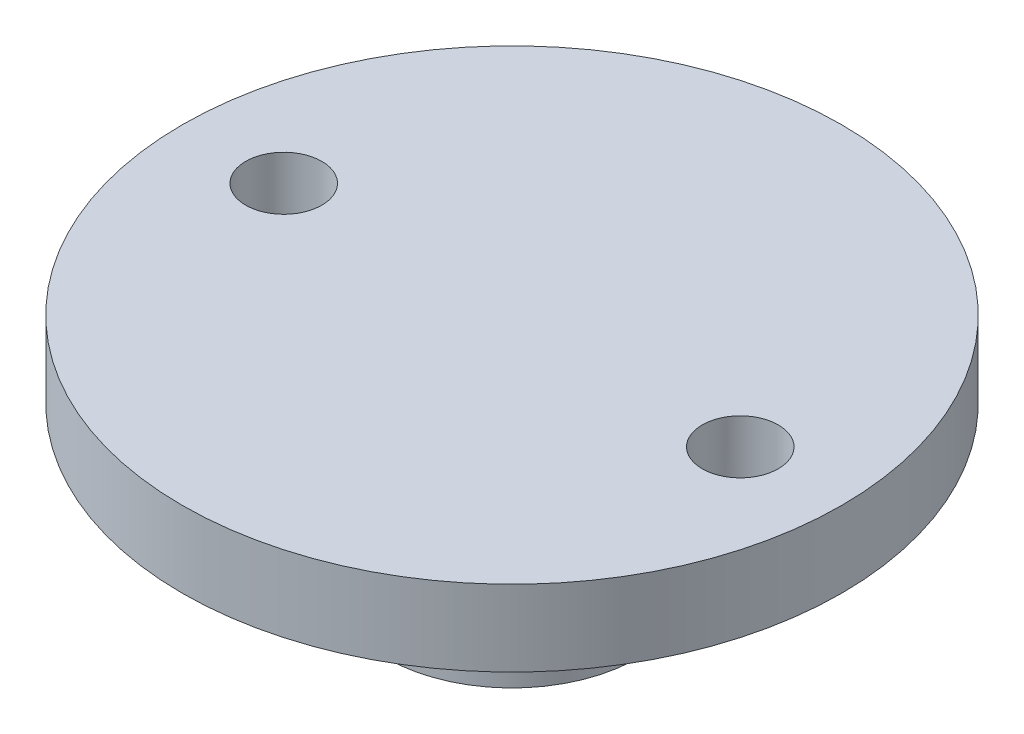
ISO-10303-21;
HEADER;
FILE_DESCRIPTION(('STEP AP214'),'2;1');
FILE_NAME('part.step','',(''),(''),'','','');
FILE_SCHEMA(('AUTOMOTIVE_DESIGN { 1 0 10303 214 1 1 1 1 }'));
ENDSEC;
DATA;
#1=APPLICATION_CONTEXT('core data for automotive mechanical design processes');
#2=APPLICATION_PROTOCOL_DEFINITION('international standard','automotive_design',2000,#1);
#3=PRODUCT_CONTEXT('',#1,'mechanical');
#4=PRODUCT('Part','Part','',(#3));
#5=PRODUCT_RELATED_PRODUCT_CATEGORY('part','',(#4));
#6=PRODUCT_DEFINITION_FORMATION('','',#4);
#7=PRODUCT_DEFINITION_CONTEXT('part definition',#1,'design');
#8=PRODUCT_DEFINITION('design','',#6,#7);
#9=PRODUCT_DEFINITION_SHAPE('','',#8);
#10=(LENGTH_UNIT() NAMED_UNIT(*) SI_UNIT(.MILLI.,.METRE.));
#11=(NAMED_UNIT(*) PLANE_ANGLE_UNIT() SI_UNIT($,.RADIAN.));
#12=(NAMED_UNIT(*) SI_UNIT($,.STERADIAN.) SOLID_ANGLE_UNIT());
#13=UNCERTAINTY_MEASURE_WITH_UNIT(LENGTH_MEASURE(1.E-05),#10,'distance_accuracy_value','');
#14=(GEOMETRIC_REPRESENTATION_CONTEXT(3) GLOBAL_UNCERTAINTY_ASSIGNED_CONTEXT((#13)) GLOBAL_UNIT_ASSIGNED_CONTEXT((#10,
#11,#12)) REPRESENTATION_CONTEXT('',''));
#15=CARTESIAN_POINT('',(0.,0.,0.));
#16=DIRECTION('',(0.,0.,1.));
#17=DIRECTION('',(1.,0.,0.));
#18=AXIS2_PLACEMENT_3D('',#15,#16,#17);
#19=CARTESIAN_POINT('',(0.,0.,0.));
#20=DIRECTION('',(0.,1.,0.));
#21=DIRECTION('',(0.,0.,1.));
#22=AXIS2_PLACEMENT_3D('',#19,#20,#21);
#23=PLANE('',#22);
#24=CARTESIAN_POINT('',(-9.,0.,0.));
#25=DIRECTION('',(0.,1.,0.));
#26=DIRECTION('',(0.,0.,-1.));
#27=AXIS2_PLACEMENT_3D('',#24,#25,#26);
#28=CIRCLE('',#27,1.5);
#29=CARTESIAN_POINT('',(-9.,0.,-1.5));
#30=VERTEX_POINT('',#29);
#31=EDGE_CURVE('E59',#30,#30,#28,.T.);
#32=ORIENTED_EDGE('',*,*,#31,.F.);
#33=EDGE_LOOP('',(#32));
#34=FACE_BOUND('',#33,.T.);
#35=CARTESIAN_POINT('',(9.,0.,0.));
#36=DIRECTION('',(0.,1.,0.));
#37=DIRECTION('',(0.,0.,1.));
#38=AXIS2_PLACEMENT_3D('',#35,#36,#37);
#39=CIRCLE('',#38,1.5);
#40=CARTESIAN_POINT('',(9.,0.,1.5));
#41=VERTEX_POINT('',#40);
#42=EDGE_CURVE('E48',#41,#41,#39,.T.);
#43=ORIENTED_EDGE('',*,*,#42,.F.);
#44=EDGE_LOOP('',(#43));
#45=FACE_BOUND('',#44,.T.);
#46=CARTESIAN_POINT('',(0.,0.,0.));
#47=DIRECTION('',(0.,-1.,0.));
#48=DIRECTION('',(0.,0.,-1.));
#49=AXIS2_PLACEMENT_3D('',#46,#47,#48);
#50=CIRCLE('',#49,13.);
#51=CARTESIAN_POINT('',(0.,0.,-13.));
#52=VERTEX_POINT('',#51);
#53=EDGE_CURVE('E10',#52,#52,#50,.T.);
#54=ORIENTED_EDGE('',*,*,#53,.F.);
#55=EDGE_LOOP('',(#54));
#56=FACE_BOUND('',#55,.T.);
#57=ADVANCED_FACE('F30',(#34,#45,#56),#23,.T.);
#58=CARTESIAN_POINT('',(0.,0.,0.));
#59=DIRECTION('',(0.,-1.,0.));
#60=DIRECTION('',(0.,0.,-1.));
#61=AXIS2_PLACEMENT_3D('',#58,#59,#60);
#62=CYLINDRICAL_SURFACE('',#61,13.);
#63=ORIENTED_EDGE('',*,*,#53,.T.);
#64=EDGE_LOOP('',(#63));
#65=FACE_BOUND('',#64,.T.);
#66=CARTESIAN_POINT('',(0.,-3.,0.));
#67=DIRECTION('',(0.,-1.,0.));
#68=DIRECTION('',(0.,0.,-1.));
#69=AXIS2_PLACEMENT_3D('',#66,#67,#68);
#70=CIRCLE('',#69,13.);
#71=CARTESIAN_POINT('',(0.,-3.,-13.));
#72=VERTEX_POINT('',#71);
#73=EDGE_CURVE('E37',#72,#72,#70,.T.);
#74=ORIENTED_EDGE('',*,*,#73,.F.);
#75=EDGE_LOOP('',(#74));
#76=FACE_BOUND('',#75,.T.);
#77=ADVANCED_FACE('F74',(#65,#76),#62,.T.);
#78=CARTESIAN_POINT('',(13.,-3.,0.));
#79=DIRECTION('',(0.,-1.,0.));
#80=DIRECTION('',(0.,0.,-1.));
#81=AXIS2_PLACEMENT_3D('',#78,#79,#80);
#82=PLANE('',#81);
#83=CARTESIAN_POINT('',(-9.,-3.,0.));
#84=DIRECTION('',(0.,-1.,0.));
#85=DIRECTION('',(0.,0.,-1.));
#86=AXIS2_PLACEMENT_3D('',#83,#84,#85);
#87=CIRCLE('',#86,1.5);
#88=CARTESIAN_POINT('',(-9.,-3.,-1.5));
#89=VERTEX_POINT('',#88);
#90=EDGE_CURVE('E33',#89,#89,#87,.T.);
#91=ORIENTED_EDGE('',*,*,#90,.F.);
#92=EDGE_LOOP('',(#91));
#93=FACE_BOUND('',#92,.T.);
#94=CARTESIAN_POINT('',(9.,-3.,0.));
#95=DIRECTION('',(0.,-1.,0.));
#96=DIRECTION('',(0.,0.,-1.));
#97=AXIS2_PLACEMENT_3D('',#94,#95,#96);
#98=CIRCLE('',#97,1.5);
#99=CARTESIAN_POINT('',(9.,-3.,-1.5));
#100=VERTEX_POINT('',#99);
#101=EDGE_CURVE('E45',#100,#100,#98,.T.);
#102=ORIENTED_EDGE('',*,*,#101,.F.);
#103=EDGE_LOOP('',(#102));
#104=FACE_BOUND('',#103,.T.);
#105=ORIENTED_EDGE('',*,*,#73,.T.);
#106=EDGE_LOOP('',(#105));
#107=FACE_BOUND('',#106,.T.);
#108=CARTESIAN_POINT('',(0.,-3.,0.));
#109=DIRECTION('',(0.,-1.,0.));
#110=DIRECTION('',(0.,0.,-1.));
#111=AXIS2_PLACEMENT_3D('',#108,#109,#110);
#112=CIRCLE('',#111,5.);
#113=CARTESIAN_POINT('',(0.,-3.,-5.));
#114=VERTEX_POINT('',#113);
#115=EDGE_CURVE('E42',#114,#114,#112,.T.);
#116=ORIENTED_EDGE('',*,*,#115,.F.);
#117=EDGE_LOOP('',(#116));
#118=FACE_BOUND('',#117,.T.);
#119=ADVANCED_FACE('F72',(#93,#104,#107,#118),#82,.T.);
#120=CARTESIAN_POINT('',(0.,0.,0.));
#121=DIRECTION('',(0.,-1.,0.));
#122=DIRECTION('',(0.,0.,-1.));
#123=AXIS2_PLACEMENT_3D('',#120,#121,#122);
#124=CYLINDRICAL_SURFACE('',#123,5.);
#125=ORIENTED_EDGE('',*,*,#115,.T.);
#126=EDGE_LOOP('',(#125));
#127=FACE_BOUND('',#126,.T.);
#128=CARTESIAN_POINT('',(0.,-9.2,0.));
#129=DIRECTION('',(0.,-1.,0.));
#130=DIRECTION('',(0.,0.,-1.));
#131=AXIS2_PLACEMENT_3D('',#128,#129,#130);
#132=CIRCLE('',#131,5.);
#133=CARTESIAN_POINT('',(0.,-9.2,-5.));
#134=VERTEX_POINT('',#133);
#135=EDGE_CURVE('E64',#134,#134,#132,.T.);
#136=ORIENTED_EDGE('',*,*,#135,.F.);
#137=EDGE_LOOP('',(#136));
#138=FACE_BOUND('',#137,.T.);
#139=ADVANCED_FACE('F69',(#127,#138),#124,.T.);
#140=CARTESIAN_POINT('',(5.,-9.2,0.));
#141=DIRECTION('',(0.,-1.,0.));
#142=DIRECTION('',(0.,0.,-1.));
#143=AXIS2_PLACEMENT_3D('',#140,#141,#142);
#144=PLANE('',#143);
#145=ORIENTED_EDGE('',*,*,#135,.T.);
#146=EDGE_LOOP('',(#145));
#147=FACE_BOUND('',#146,.T.);
#148=CARTESIAN_POINT('',(0.,-9.2,0.));
#149=DIRECTION('',(0.,-1.,0.));
#150=DIRECTION('',(0.,0.,-1.));
#151=AXIS2_PLACEMENT_3D('',#148,#149,#150);
#152=CIRCLE('',#151,3.);
#153=CARTESIAN_POINT('',(0.,-9.2,-3.));
#154=VERTEX_POINT('',#153);
#155=EDGE_CURVE('E52',#154,#154,#152,.T.);
#156=ORIENTED_EDGE('',*,*,#155,.F.);
#157=EDGE_LOOP('',(#156));
#158=FACE_BOUND('',#157,.T.);
#159=ADVANCED_FACE('F81',(#147,#158),#144,.T.);
#160=CARTESIAN_POINT('',(0.,0.,0.));
#161=DIRECTION('',(0.,-1.,0.));
#162=DIRECTION('',(0.,0.,-1.));
#163=AXIS2_PLACEMENT_3D('',#160,#161,#162);
#164=CYLINDRICAL_SURFACE('',#163,3.);
#165=ORIENTED_EDGE('',*,*,#155,.T.);
#166=EDGE_LOOP('',(#165));
#167=FACE_BOUND('',#166,.T.);
#168=CARTESIAN_POINT('',(0.,-6.2,0.));
#169=DIRECTION('',(0.,-1.,0.));
#170=DIRECTION('',(0.,0.,-1.));
#171=AXIS2_PLACEMENT_3D('',#168,#169,#170);
#172=CIRCLE('',#171,3.);
#173=CARTESIAN_POINT('',(0.,-6.2,-3.));
#174=VERTEX_POINT('',#173);
#175=EDGE_CURVE('E47',#174,#174,#172,.T.);
#176=ORIENTED_EDGE('',*,*,#175,.F.);
#177=EDGE_LOOP('',(#176));
#178=FACE_BOUND('',#177,.T.);
#179=ADVANCED_FACE('F107',(#167,#178),#164,.F.);
#180=CARTESIAN_POINT('',(3.,-6.2,0.));
#181=DIRECTION('',(0.,-1.,0.));
#182=DIRECTION('',(0.,0.,-1.));
#183=AXIS2_PLACEMENT_3D('',#180,#181,#182);
#184=PLANE('',#183);
#185=ORIENTED_EDGE('',*,*,#175,.T.);
#186=EDGE_LOOP('',(#185));
#187=FACE_BOUND('',#186,.T.);
#188=ADVANCED_FACE('F102',(#187),#184,.T.);
#189=CARTESIAN_POINT('',(9.,-9.2,0.));
#190=DIRECTION('',(0.,1.,0.));
#191=DIRECTION('',(0.,0.,1.));
#192=AXIS2_PLACEMENT_3D('',#189,#190,#191);
#193=CYLINDRICAL_SURFACE('',#192,1.5);
#194=ORIENTED_EDGE('',*,*,#101,.T.);
#195=EDGE_LOOP('',(#194));
#196=FACE_BOUND('',#195,.T.);
#197=ORIENTED_EDGE('',*,*,#42,.T.);
#198=EDGE_LOOP('',(#197));
#199=FACE_BOUND('',#198,.T.);
#200=ADVANCED_FACE('F96',(#196,#199),#193,.F.);
#201=CARTESIAN_POINT('',(-9.,-9.2,0.));
#202=DIRECTION('',(0.,1.,0.));
#203=DIRECTION('',(0.,0.,1.));
#204=AXIS2_PLACEMENT_3D('',#201,#202,#203);
#205=CYLINDRICAL_SURFACE('',#204,1.5);
#206=ORIENTED_EDGE('',*,*,#90,.T.);
#207=EDGE_LOOP('',(#206));
#208=FACE_BOUND('',#207,.T.);
#209=ORIENTED_EDGE('',*,*,#31,.T.);
#210=EDGE_LOOP('',(#209));
#211=FACE_BOUND('',#210,.T.);
#212=ADVANCED_FACE('F94',(#208,#211),#205,.F.);
#213=CLOSED_SHELL('',(#57,#77,#119,#139,#159,#179,#188,#200,#212));
#214=MANIFOLD_SOLID_BREP('B2',#213);
#215=ADVANCED_BREP_SHAPE_REPRESENTATION('',(#18,#214),#14);
#216=SHAPE_DEFINITION_REPRESENTATION(#9,#215);
ENDSEC;
END-ISO-10303-21;
